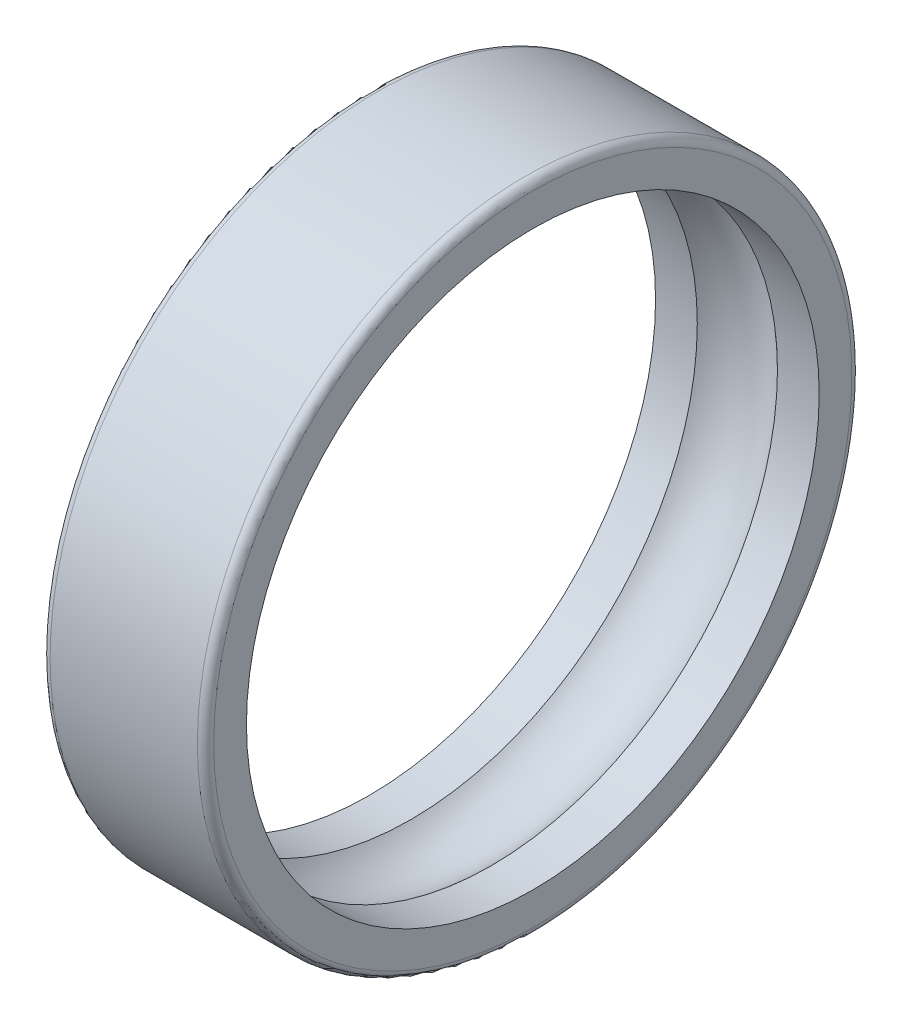
ISO-10303-21;
HEADER;
FILE_DESCRIPTION(('STEP AP214'),'2;1');
FILE_NAME('part.step','',(''),(''),'','','');
FILE_SCHEMA(('AUTOMOTIVE_DESIGN { 1 0 10303 214 1 1 1 1 }'));
ENDSEC;
DATA;
#1=APPLICATION_CONTEXT('core data for automotive mechanical design processes');
#2=APPLICATION_PROTOCOL_DEFINITION('international standard','automotive_design',2000,#1);
#3=PRODUCT_CONTEXT('',#1,'mechanical');
#4=PRODUCT('Part','Part','',(#3));
#5=PRODUCT_RELATED_PRODUCT_CATEGORY('part','',(#4));
#6=PRODUCT_DEFINITION_FORMATION('','',#4);
#7=PRODUCT_DEFINITION_CONTEXT('part definition',#1,'design');
#8=PRODUCT_DEFINITION('design','',#6,#7);
#9=PRODUCT_DEFINITION_SHAPE('','',#8);
#10=(LENGTH_UNIT() NAMED_UNIT(*) SI_UNIT(.MILLI.,.METRE.));
#11=(NAMED_UNIT(*) PLANE_ANGLE_UNIT() SI_UNIT($,.RADIAN.));
#12=(NAMED_UNIT(*) SI_UNIT($,.STERADIAN.) SOLID_ANGLE_UNIT());
#13=UNCERTAINTY_MEASURE_WITH_UNIT(LENGTH_MEASURE(1.E-05),#10,'distance_accuracy_value','');
#14=(GEOMETRIC_REPRESENTATION_CONTEXT(3) GLOBAL_UNCERTAINTY_ASSIGNED_CONTEXT((#13)) GLOBAL_UNIT_ASSIGNED_CONTEXT((#10,
#11,#12)) REPRESENTATION_CONTEXT('',''));
#15=CARTESIAN_POINT('',(0.,0.,0.));
#16=DIRECTION('',(0.,0.,1.));
#17=DIRECTION('',(1.,0.,0.));
#18=AXIS2_PLACEMENT_3D('',#15,#16,#17);
#19=CARTESIAN_POINT('',(0.,7.8,0.));
#20=DIRECTION('',(1.,0.,0.));
#21=DIRECTION('',(0.,0.,-1.));
#22=AXIS2_PLACEMENT_3D('',#19,#20,#21);
#23=PLANE('',#22);
#24=CARTESIAN_POINT('',(0.,0.,0.));
#25=DIRECTION('',(-1.,0.,0.));
#26=DIRECTION('',(0.,0.,1.));
#27=AXIS2_PLACEMENT_3D('',#24,#25,#26);
#28=CIRCLE('',#27,7.);
#29=CARTESIAN_POINT('',(0.,0.,7.));
#30=VERTEX_POINT('',#29);
#31=EDGE_CURVE('E10',#30,#30,#28,.T.);
#32=ORIENTED_EDGE('',*,*,#31,.F.);
#33=EDGE_LOOP('',(#32));
#34=FACE_BOUND('',#33,.T.);
#35=CARTESIAN_POINT('',(0.,0.,0.));
#36=DIRECTION('',(-1.,0.,0.));
#37=DIRECTION('',(0.,0.,1.));
#38=AXIS2_PLACEMENT_3D('',#35,#36,#37);
#39=CIRCLE('',#38,7.8);
#40=CARTESIAN_POINT('',(0.,0.,7.8));
#41=VERTEX_POINT('',#40);
#42=EDGE_CURVE('E57',#41,#41,#39,.T.);
#43=ORIENTED_EDGE('',*,*,#42,.T.);
#44=EDGE_LOOP('',(#43));
#45=FACE_BOUND('',#44,.T.);
#46=ADVANCED_FACE('F29',(#34,#45),#23,.F.);
#47=CARTESIAN_POINT('',(0.,0.,0.));
#48=DIRECTION('',(-1.,0.,0.));
#49=DIRECTION('',(0.,0.,1.));
#50=AXIS2_PLACEMENT_3D('',#47,#48,#49);
#51=CYLINDRICAL_SURFACE('',#50,7.);
#52=CARTESIAN_POINT('',(1.02020410288673,0.,0.));
#53=DIRECTION('',(-1.,0.,0.));
#54=DIRECTION('',(0.,0.,1.));
#55=AXIS2_PLACEMENT_3D('',#52,#53,#54);
#56=CIRCLE('',#55,7.);
#57=CARTESIAN_POINT('',(1.02020410288673,0.,7.));
#58=VERTEX_POINT('',#57);
#59=EDGE_CURVE('E35',#58,#58,#56,.T.);
#60=ORIENTED_EDGE('',*,*,#59,.F.);
#61=EDGE_LOOP('',(#60));
#62=FACE_BOUND('',#61,.T.);
#63=ORIENTED_EDGE('',*,*,#31,.T.);
#64=EDGE_LOOP('',(#63));
#65=FACE_BOUND('',#64,.T.);
#66=ADVANCED_FACE('F80',(#62,#65),#51,.F.);
#67=CARTESIAN_POINT('',(2.,0.,0.));
#68=DIRECTION('',(-1.,0.,0.));
#69=DIRECTION('',(0.,0.,1.));
#70=AXIS2_PLACEMENT_3D('',#67,#68,#69);
#71=TOROIDAL_SURFACE('',#70,6.,1.4);
#72=ORIENTED_EDGE('',*,*,#59,.T.);
#73=EDGE_LOOP('',(#72));
#74=FACE_BOUND('',#73,.T.);
#75=CARTESIAN_POINT('',(2.97979589711327,0.,0.));
#76=DIRECTION('',(-1.,0.,0.));
#77=DIRECTION('',(0.,0.,1.));
#78=AXIS2_PLACEMENT_3D('',#75,#76,#77);
#79=CIRCLE('',#78,7.);
#80=CARTESIAN_POINT('',(2.97979589711327,0.,7.));
#81=VERTEX_POINT('',#80);
#82=EDGE_CURVE('E39',#81,#81,#79,.T.);
#83=ORIENTED_EDGE('',*,*,#82,.F.);
#84=EDGE_LOOP('',(#83));
#85=FACE_BOUND('',#84,.T.);
#86=ADVANCED_FACE('F85',(#74,#85),#71,.F.);
#87=CARTESIAN_POINT('',(0.,0.,0.));
#88=DIRECTION('',(-1.,0.,0.));
#89=DIRECTION('',(0.,0.,1.));
#90=AXIS2_PLACEMENT_3D('',#87,#88,#89);
#91=CYLINDRICAL_SURFACE('',#90,7.);
#92=CARTESIAN_POINT('',(4.,0.,0.));
#93=DIRECTION('',(-1.,0.,0.));
#94=DIRECTION('',(0.,0.,1.));
#95=AXIS2_PLACEMENT_3D('',#92,#93,#94);
#96=CIRCLE('',#95,7.);
#97=CARTESIAN_POINT('',(4.,0.,7.));
#98=VERTEX_POINT('',#97);
#99=EDGE_CURVE('E43',#98,#98,#96,.T.);
#100=ORIENTED_EDGE('',*,*,#99,.F.);
#101=EDGE_LOOP('',(#100));
#102=FACE_BOUND('',#101,.T.);
#103=ORIENTED_EDGE('',*,*,#82,.T.);
#104=EDGE_LOOP('',(#103));
#105=FACE_BOUND('',#104,.T.);
#106=ADVANCED_FACE('F90',(#102,#105),#91,.F.);
#107=CARTESIAN_POINT('',(4.,7.,0.));
#108=DIRECTION('',(-1.,0.,0.));
#109=DIRECTION('',(0.,0.,1.));
#110=AXIS2_PLACEMENT_3D('',#107,#108,#109);
#111=PLANE('',#110);
#112=CARTESIAN_POINT('',(4.,0.,0.));
#113=DIRECTION('',(-1.,0.,0.));
#114=DIRECTION('',(0.,0.,1.));
#115=AXIS2_PLACEMENT_3D('',#112,#113,#114);
#116=CIRCLE('',#115,7.8);
#117=CARTESIAN_POINT('',(4.,0.,7.8));
#118=VERTEX_POINT('',#117);
#119=EDGE_CURVE('E48',#118,#118,#116,.T.);
#120=ORIENTED_EDGE('',*,*,#119,.F.);
#121=EDGE_LOOP('',(#120));
#122=FACE_BOUND('',#121,.T.);
#123=ORIENTED_EDGE('',*,*,#99,.T.);
#124=EDGE_LOOP('',(#123));
#125=FACE_BOUND('',#124,.T.);
#126=ADVANCED_FACE('F76',(#122,#125),#111,.F.);
#127=CARTESIAN_POINT('',(3.8,0.,0.));
#128=DIRECTION('',(-1.,0.,0.));
#129=DIRECTION('',(0.,0.,1.));
#130=AXIS2_PLACEMENT_3D('',#127,#128,#129);
#131=TOROIDAL_SURFACE('',#130,7.8,0.2);
#132=CARTESIAN_POINT('',(3.8,0.,0.));
#133=DIRECTION('',(-1.,0.,0.));
#134=DIRECTION('',(0.,0.,1.));
#135=AXIS2_PLACEMENT_3D('',#132,#133,#134);
#136=CIRCLE('',#135,8.);
#137=CARTESIAN_POINT('',(3.8,0.,8.));
#138=VERTEX_POINT('',#137);
#139=EDGE_CURVE('E51',#138,#138,#136,.T.);
#140=ORIENTED_EDGE('',*,*,#139,.F.);
#141=EDGE_LOOP('',(#140));
#142=FACE_BOUND('',#141,.T.);
#143=ORIENTED_EDGE('',*,*,#119,.T.);
#144=EDGE_LOOP('',(#143));
#145=FACE_BOUND('',#144,.T.);
#146=ADVANCED_FACE('F70',(#142,#145),#131,.T.);
#147=CARTESIAN_POINT('',(0.,0.,0.));
#148=DIRECTION('',(-1.,0.,0.));
#149=DIRECTION('',(0.,0.,1.));
#150=AXIS2_PLACEMENT_3D('',#147,#148,#149);
#151=CYLINDRICAL_SURFACE('',#150,8.);
#152=ORIENTED_EDGE('',*,*,#139,.T.);
#153=EDGE_LOOP('',(#152));
#154=FACE_BOUND('',#153,.T.);
#155=CARTESIAN_POINT('',(0.2,0.,0.));
#156=DIRECTION('',(-1.,0.,0.));
#157=DIRECTION('',(0.,0.,1.));
#158=AXIS2_PLACEMENT_3D('',#155,#156,#157);
#159=CIRCLE('',#158,8.);
#160=CARTESIAN_POINT('',(0.2,0.,8.));
#161=VERTEX_POINT('',#160);
#162=EDGE_CURVE('E54',#161,#161,#159,.T.);
#163=ORIENTED_EDGE('',*,*,#162,.F.);
#164=EDGE_LOOP('',(#163));
#165=FACE_BOUND('',#164,.T.);
#166=ADVANCED_FACE('F65',(#154,#165),#151,.T.);
#167=CARTESIAN_POINT('',(0.2,0.,0.));
#168=DIRECTION('',(-1.,0.,0.));
#169=DIRECTION('',(0.,0.,1.));
#170=AXIS2_PLACEMENT_3D('',#167,#168,#169);
#171=TOROIDAL_SURFACE('',#170,7.8,0.2);
#172=ORIENTED_EDGE('',*,*,#42,.F.);
#173=EDGE_LOOP('',(#172));
#174=FACE_BOUND('',#173,.T.);
#175=ORIENTED_EDGE('',*,*,#162,.T.);
#176=EDGE_LOOP('',(#175));
#177=FACE_BOUND('',#176,.T.);
#178=ADVANCED_FACE('F62',(#174,#177),#171,.T.);
#179=CLOSED_SHELL('',(#46,#66,#86,#106,#126,#146,#166,#178));
#180=MANIFOLD_SOLID_BREP('B2',#179);
#181=ADVANCED_BREP_SHAPE_REPRESENTATION('',(#18,#180),#14);
#182=SHAPE_DEFINITION_REPRESENTATION(#9,#181);
ENDSEC;
END-ISO-10303-21;
